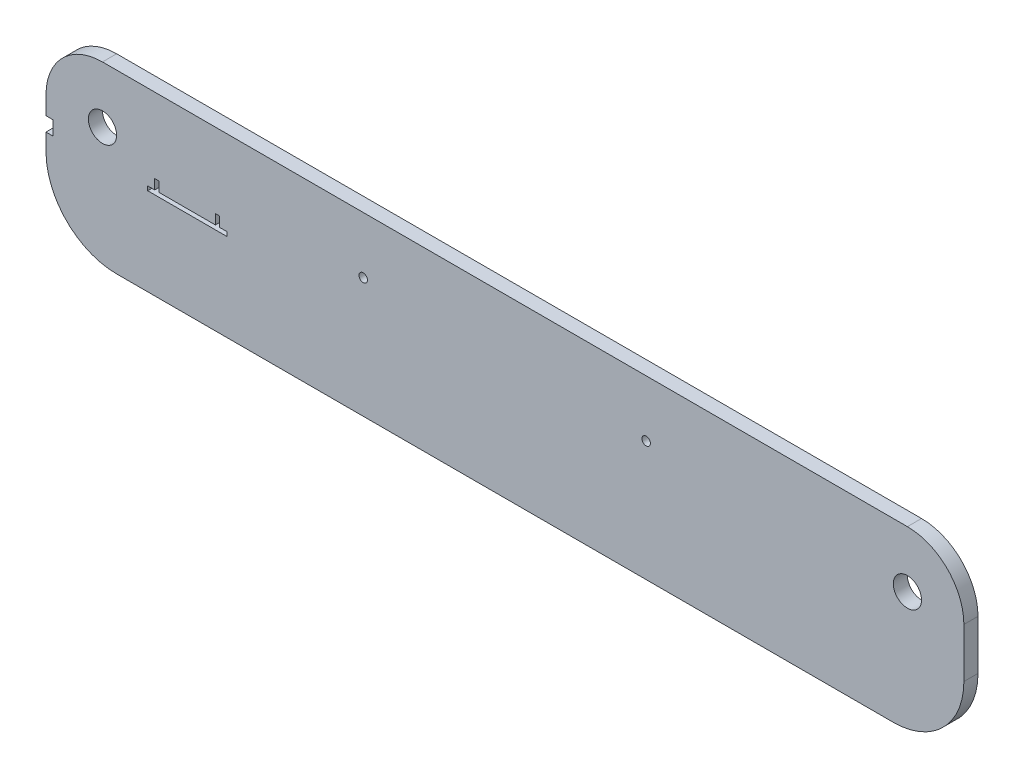
ISO-10303-21;
HEADER;
FILE_DESCRIPTION(('STEP AP214'),'2;1');
FILE_NAME('part.step','',(''),(''),'','','');
FILE_SCHEMA(('AUTOMOTIVE_DESIGN { 1 0 10303 214 1 1 1 1 }'));
ENDSEC;
DATA;
#1=APPLICATION_CONTEXT('core data for automotive mechanical design processes');
#2=APPLICATION_PROTOCOL_DEFINITION('international standard','automotive_design',2000,#1);
#3=PRODUCT_CONTEXT('',#1,'mechanical');
#4=PRODUCT('Part','Part','',(#3));
#5=PRODUCT_RELATED_PRODUCT_CATEGORY('part','',(#4));
#6=PRODUCT_DEFINITION_FORMATION('','',#4);
#7=PRODUCT_DEFINITION_CONTEXT('part definition',#1,'design');
#8=PRODUCT_DEFINITION('design','',#6,#7);
#9=PRODUCT_DEFINITION_SHAPE('','',#8);
#10=(LENGTH_UNIT() NAMED_UNIT(*) SI_UNIT(.MILLI.,.METRE.));
#11=(NAMED_UNIT(*) PLANE_ANGLE_UNIT() SI_UNIT($,.RADIAN.));
#12=(NAMED_UNIT(*) SI_UNIT($,.STERADIAN.) SOLID_ANGLE_UNIT());
#13=UNCERTAINTY_MEASURE_WITH_UNIT(LENGTH_MEASURE(1.E-05),#10,'distance_accuracy_value','');
#14=(GEOMETRIC_REPRESENTATION_CONTEXT(3) GLOBAL_UNCERTAINTY_ASSIGNED_CONTEXT((#13)) GLOBAL_UNIT_ASSIGNED_CONTEXT((#10,
#11,#12)) REPRESENTATION_CONTEXT('',''));
#15=CARTESIAN_POINT('',(0.,0.,0.));
#16=DIRECTION('',(0.,0.,1.));
#17=DIRECTION('',(1.,0.,0.));
#18=AXIS2_PLACEMENT_3D('',#15,#16,#17);
#19=CARTESIAN_POINT('',(0.,0.,10.));
#20=DIRECTION('',(0.,0.,1.));
#21=DIRECTION('',(1.,0.,0.));
#22=AXIS2_PLACEMENT_3D('',#19,#20,#21);
#23=PLANE('',#22);
#24=DIRECTION('',(0.,-1.,0.));
#25=VECTOR('',#24,1.);
#26=CARTESIAN_POINT('',(29.895928309746,35.3096819482084,10.));
#27=LINE('',#26,#25);
#28=CARTESIAN_POINT('',(29.895928309746,35.3096819482084,10.));
#29=VERTEX_POINT('',#28);
#30=CARTESIAN_POINT('',(29.895928309746,28.3096819482084,10.));
#31=VERTEX_POINT('',#30);
#32=EDGE_CURVE('E277',#29,#31,#27,.T.);
#33=ORIENTED_EDGE('',*,*,#32,.F.);
#34=DIRECTION('',(-1.,0.,0.));
#35=VECTOR('',#34,1.);
#36=CARTESIAN_POINT('',(32.895928309746,35.3096819482084,10.));
#37=LINE('',#36,#35);
#38=CARTESIAN_POINT('',(32.895928309746,35.3096819482084,10.));
#39=VERTEX_POINT('',#38);
#40=EDGE_CURVE('E284',#39,#29,#37,.T.);
#41=ORIENTED_EDGE('',*,*,#40,.F.);
#42=DIRECTION('',(0.,1.,0.));
#43=VECTOR('',#42,1.);
#44=CARTESIAN_POINT('',(32.895928309746,28.3096819482084,10.));
#45=LINE('',#44,#43);
#46=CARTESIAN_POINT('',(32.895928309746,28.3096819482084,10.));
#47=VERTEX_POINT('',#46);
#48=EDGE_CURVE('E282',#47,#39,#45,.T.);
#49=ORIENTED_EDGE('',*,*,#48,.F.);
#50=DIRECTION('',(-1.,0.,0.));
#51=VECTOR('',#50,1.);
#52=CARTESIAN_POINT('',(72.895928309746,28.3096819482084,10.));
#53=LINE('',#52,#51);
#54=CARTESIAN_POINT('',(72.895928309746,28.3096819482084,10.));
#55=VERTEX_POINT('',#54);
#56=EDGE_CURVE('E221',#55,#47,#53,.T.);
#57=ORIENTED_EDGE('',*,*,#56,.F.);
#58=DIRECTION('',(0.,1.,0.));
#59=VECTOR('',#58,1.);
#60=CARTESIAN_POINT('',(72.895928309746,0.,10.));
#61=LINE('',#60,#59);
#62=CARTESIAN_POINT('',(72.895928309746,35.3096819482084,10.));
#63=VERTEX_POINT('',#62);
#64=EDGE_CURVE('E206',#55,#63,#61,.T.);
#65=ORIENTED_EDGE('',*,*,#64,.T.);
#66=DIRECTION('',(1.,0.,0.));
#67=VECTOR('',#66,1.);
#68=CARTESIAN_POINT('',(-24.104071690254,35.3096819482084,10.));
#69=LINE('',#68,#67);
#70=CARTESIAN_POINT('',(75.895928309746,35.3096819482084,10.));
#71=VERTEX_POINT('',#70);
#72=EDGE_CURVE('E199',#63,#71,#69,.T.);
#73=ORIENTED_EDGE('',*,*,#72,.T.);
#74=DIRECTION('',(0.,1.,0.));
#75=VECTOR('',#74,1.);
#76=CARTESIAN_POINT('',(75.895928309746,71.3096819482084,10.));
#77=LINE('',#76,#75);
#78=CARTESIAN_POINT('',(75.895928309746,28.3096819482084,10.));
#79=VERTEX_POINT('',#78);
#80=EDGE_CURVE('E204',#79,#71,#77,.T.);
#81=ORIENTED_EDGE('',*,*,#80,.F.);
#82=DIRECTION('',(-1.,0.,0.));
#83=VECTOR('',#82,1.);
#84=CARTESIAN_POINT('',(0.,28.3096819482084,10.));
#85=LINE('',#84,#83);
#86=CARTESIAN_POINT('',(80.895928309746,28.3096819482084,10.));
#87=VERTEX_POINT('',#86);
#88=EDGE_CURVE('E235',#87,#79,#85,.T.);
#89=ORIENTED_EDGE('',*,*,#88,.F.);
#90=DIRECTION('',(0.,1.,0.));
#91=VECTOR('',#90,1.);
#92=CARTESIAN_POINT('',(80.895928309746,0.,10.));
#93=LINE('',#92,#91);
#94=CARTESIAN_POINT('',(80.895928309746,25.3096819482084,10.));
#95=VERTEX_POINT('',#94);
#96=EDGE_CURVE('E243',#95,#87,#93,.T.);
#97=ORIENTED_EDGE('',*,*,#96,.F.);
#98=DIRECTION('',(1.,0.,0.));
#99=VECTOR('',#98,1.);
#100=CARTESIAN_POINT('',(75.895928309746,25.3096819482084,10.));
#101=LINE('',#100,#99);
#102=CARTESIAN_POINT('',(24.895928309746,25.3096819482084,10.));
#103=VERTEX_POINT('',#102);
#104=EDGE_CURVE('E222',#103,#95,#101,.T.);
#105=ORIENTED_EDGE('',*,*,#104,.F.);
#106=DIRECTION('',(0.,1.,0.));
#107=VECTOR('',#106,1.);
#108=CARTESIAN_POINT('',(24.895928309746,0.,10.));
#109=LINE('',#108,#107);
#110=CARTESIAN_POINT('',(24.895928309746,28.3096819482084,10.));
#111=VERTEX_POINT('',#110);
#112=EDGE_CURVE('E240',#103,#111,#109,.T.);
#113=ORIENTED_EDGE('',*,*,#112,.T.);
#114=DIRECTION('',(1.,0.,0.));
#115=VECTOR('',#114,1.);
#116=CARTESIAN_POINT('',(0.,28.3096819482084,10.));
#117=LINE('',#116,#115);
#118=EDGE_CURVE('E237',#111,#31,#117,.T.);
#119=ORIENTED_EDGE('',*,*,#118,.T.);
#120=EDGE_LOOP('',(#33,#41,#49,#57,#65,#73,#81,#89,#97,#105,#113,#119));
#121=FACE_BOUND('',#120,.T.);
#122=CARTESIAN_POINT('',(2.89592830974606,13.3096819482084,10.));
#123=DIRECTION('',(0.,0.,1.));
#124=DIRECTION('',(1.,0.,0.));
#125=AXIS2_PLACEMENT_3D('',#122,#123,#124);
#126=CIRCLE('',#125,50.);
#127=CARTESIAN_POINT('',(-47.1040716902539,13.3096819482084,10.));
#128=VERTEX_POINT('',#127);
#129=CARTESIAN_POINT('',(2.89592830974606,-36.6903180517916,10.));
#130=VERTEX_POINT('',#129);
#131=EDGE_CURVE('E355',#128,#130,#126,.T.);
#132=ORIENTED_EDGE('',*,*,#131,.T.);
#133=DIRECTION('',(1.,0.,0.));
#134=VECTOR('',#133,1.);
#135=CARTESIAN_POINT('',(-47.1040716902539,-36.6903180517916,10.));
#136=LINE('',#135,#134);
#137=CARTESIAN_POINT('',(552.895928309746,-36.6903180517916,10.));
#138=VERTEX_POINT('',#137);
#139=EDGE_CURVE('E302',#130,#138,#136,.T.);
#140=ORIENTED_EDGE('',*,*,#139,.T.);
#141=CARTESIAN_POINT('',(552.895928309746,13.3096819482084,10.));
#142=DIRECTION('',(0.,0.,1.));
#143=DIRECTION('',(1.,0.,0.));
#144=AXIS2_PLACEMENT_3D('',#141,#142,#143);
#145=CIRCLE('',#144,50.);
#146=CARTESIAN_POINT('',(602.895928309746,13.3096819482084,10.));
#147=VERTEX_POINT('',#146);
#148=EDGE_CURVE('E335',#138,#147,#145,.T.);
#149=ORIENTED_EDGE('',*,*,#148,.T.);
#150=DIRECTION('',(0.,1.,0.));
#151=VECTOR('',#150,1.);
#152=CARTESIAN_POINT('',(602.895928309746,88.3096819482084,10.));
#153=LINE('',#152,#151);
#154=CARTESIAN_POINT('',(602.895928309746,48.3096819482084,10.));
#155=VERTEX_POINT('',#154);
#156=EDGE_CURVE('E305',#147,#155,#153,.T.);
#157=ORIENTED_EDGE('',*,*,#156,.T.);
#158=CARTESIAN_POINT('',(562.895928309746,48.3096819482084,10.));
#159=DIRECTION('',(0.,0.,1.));
#160=DIRECTION('',(1.,0.,0.));
#161=AXIS2_PLACEMENT_3D('',#158,#159,#160);
#162=CIRCLE('',#161,40.);
#163=CARTESIAN_POINT('',(562.895928309746,88.3096819482084,10.));
#164=VERTEX_POINT('',#163);
#165=EDGE_CURVE('E344',#155,#164,#162,.T.);
#166=ORIENTED_EDGE('',*,*,#165,.T.);
#167=DIRECTION('',(-1.,0.,0.));
#168=VECTOR('',#167,1.);
#169=CARTESIAN_POINT('',(-47.104071690254,88.3096819482084,10.));
#170=LINE('',#169,#168);
#171=CARTESIAN_POINT('',(-7.10407169025395,88.3096819482084,10.));
#172=VERTEX_POINT('',#171);
#173=EDGE_CURVE('E308',#164,#172,#170,.T.);
#174=ORIENTED_EDGE('',*,*,#173,.T.);
#175=CARTESIAN_POINT('',(-7.10407169025395,48.3096819482084,10.));
#176=DIRECTION('',(0.,0.,1.));
#177=DIRECTION('',(1.,0.,0.));
#178=AXIS2_PLACEMENT_3D('',#175,#176,#177);
#179=CIRCLE('',#178,40.);
#180=CARTESIAN_POINT('',(-47.1040716902539,48.3096819482084,10.));
#181=VERTEX_POINT('',#180);
#182=EDGE_CURVE('E11',#172,#181,#179,.T.);
#183=ORIENTED_EDGE('',*,*,#182,.T.);
#184=DIRECTION('',(0.,-1.,0.));
#185=VECTOR('',#184,1.);
#186=CARTESIAN_POINT('',(-47.104071690254,88.3096819482084,10.));
#187=LINE('',#186,#185);
#188=CARTESIAN_POINT('',(-47.1040716902539,35.3096819482083,10.));
#189=VERTEX_POINT('',#188);
#190=EDGE_CURVE('E299',#181,#189,#187,.T.);
#191=ORIENTED_EDGE('',*,*,#190,.T.);
#192=DIRECTION('',(-1.,0.,0.));
#193=VECTOR('',#192,1.);
#194=CARTESIAN_POINT('',(-42.104071690254,35.3096819482083,10.));
#195=LINE('',#194,#193);
#196=CARTESIAN_POINT('',(-42.104071690254,35.3096819482083,10.));
#197=VERTEX_POINT('',#196);
#198=EDGE_CURVE('E255',#197,#189,#195,.T.);
#199=ORIENTED_EDGE('',*,*,#198,.F.);
#200=DIRECTION('',(0.,1.,0.));
#201=VECTOR('',#200,1.);
#202=CARTESIAN_POINT('',(-42.104071690254,25.3096819482083,10.));
#203=LINE('',#202,#201);
#204=CARTESIAN_POINT('',(-42.104071690254,25.3096819482083,10.));
#205=VERTEX_POINT('',#204);
#206=EDGE_CURVE('E246',#205,#197,#203,.T.);
#207=ORIENTED_EDGE('',*,*,#206,.F.);
#208=DIRECTION('',(-1.,0.,0.));
#209=VECTOR('',#208,1.);
#210=CARTESIAN_POINT('',(-42.104071690254,25.3096819482083,10.));
#211=LINE('',#210,#209);
#212=CARTESIAN_POINT('',(-47.1040716902539,25.3096819482083,10.));
#213=VERTEX_POINT('',#212);
#214=EDGE_CURVE('E258',#205,#213,#211,.T.);
#215=ORIENTED_EDGE('',*,*,#214,.T.);
#216=EDGE_CURVE('E303',#213,#128,#187,.T.);
#217=ORIENTED_EDGE('',*,*,#216,.T.);
#218=EDGE_LOOP('',(#132,#140,#149,#157,#166,#174,#183,#191,#199,#207,#215,#217));
#219=FACE_BOUND('',#218,.T.);
#220=CARTESIAN_POINT('',(177.509070800599,48.3096819482085,10.));
#221=DIRECTION('',(0.,0.,1.));
#222=DIRECTION('',(1.,0.,0.));
#223=AXIS2_PLACEMENT_3D('',#220,#221,#222);
#224=CIRCLE('',#223,2.99999999999999);
#225=CARTESIAN_POINT('',(180.509070800599,48.3096819482085,10.));
#226=VERTEX_POINT('',#225);
#227=EDGE_CURVE('E271',#226,#226,#224,.T.);
#228=ORIENTED_EDGE('',*,*,#227,.F.);
#229=EDGE_LOOP('',(#228));
#230=FACE_BOUND('',#229,.T.);
#231=CARTESIAN_POINT('',(377.895928309746,48.3096819482086,10.));
#232=DIRECTION('',(0.,0.,1.));
#233=DIRECTION('',(1.,0.,0.));
#234=AXIS2_PLACEMENT_3D('',#231,#232,#233);
#235=CIRCLE('',#234,2.99999999999999);
#236=CARTESIAN_POINT('',(380.895928309746,48.3096819482086,10.));
#237=VERTEX_POINT('',#236);
#238=EDGE_CURVE('E270',#237,#237,#235,.T.);
#239=ORIENTED_EDGE('',*,*,#238,.F.);
#240=EDGE_LOOP('',(#239));
#241=FACE_BOUND('',#240,.T.);
#242=CARTESIAN_POINT('',(562.895928309746,48.3096819482086,10.));
#243=DIRECTION('',(0.,0.,1.));
#244=DIRECTION('',(-1.,0.,0.));
#245=AXIS2_PLACEMENT_3D('',#242,#243,#244);
#246=CIRCLE('',#245,9.99999999999998);
#247=CARTESIAN_POINT('',(552.895928309746,48.3096819482086,10.));
#248=VERTEX_POINT('',#247);
#249=EDGE_CURVE('E286',#248,#248,#246,.T.);
#250=ORIENTED_EDGE('',*,*,#249,.F.);
#251=EDGE_LOOP('',(#250));
#252=FACE_BOUND('',#251,.T.);
#253=CARTESIAN_POINT('',(-7.10407169025393,48.3096819482084,10.));
#254=DIRECTION('',(0.,0.,1.));
#255=DIRECTION('',(1.,0.,0.));
#256=AXIS2_PLACEMENT_3D('',#253,#254,#255);
#257=CIRCLE('',#256,10.);
#258=CARTESIAN_POINT('',(2.89592830974607,48.3096819482084,10.));
#259=VERTEX_POINT('',#258);
#260=EDGE_CURVE('E290',#259,#259,#257,.T.);
#261=ORIENTED_EDGE('',*,*,#260,.F.);
#262=EDGE_LOOP('',(#261));
#263=FACE_BOUND('',#262,.T.);
#264=ADVANCED_FACE('F38',(#121,#219,#230,#241,#252,#263),#23,.T.);
#265=CARTESIAN_POINT('',(0.,0.,0.));
#266=DIRECTION('',(0.,0.,1.));
#267=DIRECTION('',(1.,0.,0.));
#268=AXIS2_PLACEMENT_3D('',#265,#266,#267);
#269=PLANE('',#268);
#270=CARTESIAN_POINT('',(-7.10407169025393,48.3096819482084,0.));
#271=DIRECTION('',(0.,0.,1.));
#272=DIRECTION('',(1.,0.,0.));
#273=AXIS2_PLACEMENT_3D('',#270,#271,#272);
#274=CIRCLE('',#273,10.);
#275=CARTESIAN_POINT('',(2.89592830974607,48.3096819482084,0.));
#276=VERTEX_POINT('',#275);
#277=EDGE_CURVE('E293',#276,#276,#274,.T.);
#278=ORIENTED_EDGE('',*,*,#277,.T.);
#279=EDGE_LOOP('',(#278));
#280=FACE_BOUND('',#279,.T.);
#281=CARTESIAN_POINT('',(562.895928309746,48.3096819482086,0.));
#282=DIRECTION('',(0.,0.,1.));
#283=DIRECTION('',(-1.,0.,0.));
#284=AXIS2_PLACEMENT_3D('',#281,#282,#283);
#285=CIRCLE('',#284,9.99999999999998);
#286=CARTESIAN_POINT('',(552.895928309746,48.3096819482086,0.));
#287=VERTEX_POINT('',#286);
#288=EDGE_CURVE('E287',#287,#287,#285,.T.);
#289=ORIENTED_EDGE('',*,*,#288,.T.);
#290=EDGE_LOOP('',(#289));
#291=FACE_BOUND('',#290,.T.);
#292=CARTESIAN_POINT('',(377.895928309746,48.3096819482086,0.));
#293=DIRECTION('',(0.,0.,1.));
#294=DIRECTION('',(1.,0.,0.));
#295=AXIS2_PLACEMENT_3D('',#292,#293,#294);
#296=CIRCLE('',#295,2.99999999999999);
#297=CARTESIAN_POINT('',(380.895928309746,48.3096819482086,0.));
#298=VERTEX_POINT('',#297);
#299=EDGE_CURVE('E274',#298,#298,#296,.T.);
#300=ORIENTED_EDGE('',*,*,#299,.T.);
#301=EDGE_LOOP('',(#300));
#302=FACE_BOUND('',#301,.T.);
#303=CARTESIAN_POINT('',(177.509070800599,48.3096819482085,0.));
#304=DIRECTION('',(0.,0.,1.));
#305=DIRECTION('',(1.,0.,0.));
#306=AXIS2_PLACEMENT_3D('',#303,#304,#305);
#307=CIRCLE('',#306,2.99999999999999);
#308=CARTESIAN_POINT('',(180.509070800599,48.3096819482085,0.));
#309=VERTEX_POINT('',#308);
#310=EDGE_CURVE('E279',#309,#309,#307,.T.);
#311=ORIENTED_EDGE('',*,*,#310,.T.);
#312=EDGE_LOOP('',(#311));
#313=FACE_BOUND('',#312,.T.);
#314=DIRECTION('',(0.,-1.,0.));
#315=VECTOR('',#314,1.);
#316=CARTESIAN_POINT('',(-47.104071690254,88.3096819482084,0.));
#317=LINE('',#316,#315);
#318=CARTESIAN_POINT('',(-47.1040716902539,25.3096819482083,0.));
#319=VERTEX_POINT('',#318);
#320=CARTESIAN_POINT('',(-47.1040716902539,13.3096819482084,0.));
#321=VERTEX_POINT('',#320);
#322=EDGE_CURVE('E296',#319,#321,#317,.T.);
#323=ORIENTED_EDGE('',*,*,#322,.F.);
#324=DIRECTION('',(-1.,0.,0.));
#325=VECTOR('',#324,1.);
#326=CARTESIAN_POINT('',(-42.104071690254,25.3096819482083,0.));
#327=LINE('',#326,#325);
#328=CARTESIAN_POINT('',(-42.104071690254,25.3096819482083,0.));
#329=VERTEX_POINT('',#328);
#330=EDGE_CURVE('E261',#329,#319,#327,.T.);
#331=ORIENTED_EDGE('',*,*,#330,.F.);
#332=DIRECTION('',(0.,-1.,0.));
#333=VECTOR('',#332,1.);
#334=CARTESIAN_POINT('',(-42.104071690254,25.3096819482083,0.));
#335=LINE('',#334,#333);
#336=CARTESIAN_POINT('',(-42.104071690254,35.3096819482083,0.));
#337=VERTEX_POINT('',#336);
#338=EDGE_CURVE('E250',#337,#329,#335,.T.);
#339=ORIENTED_EDGE('',*,*,#338,.F.);
#340=DIRECTION('',(-1.,0.,0.));
#341=VECTOR('',#340,1.);
#342=CARTESIAN_POINT('',(-42.104071690254,35.3096819482083,0.));
#343=LINE('',#342,#341);
#344=CARTESIAN_POINT('',(-47.1040716902539,35.3096819482083,0.));
#345=VERTEX_POINT('',#344);
#346=EDGE_CURVE('E263',#337,#345,#343,.T.);
#347=ORIENTED_EDGE('',*,*,#346,.T.);
#348=CARTESIAN_POINT('',(-47.1040716902539,48.3096819482084,0.));
#349=VERTEX_POINT('',#348);
#350=EDGE_CURVE('E312',#349,#345,#317,.T.);
#351=ORIENTED_EDGE('',*,*,#350,.F.);
#352=CARTESIAN_POINT('',(-7.10407169025395,48.3096819482084,0.));
#353=DIRECTION('',(0.,0.,1.));
#354=DIRECTION('',(1.,0.,0.));
#355=AXIS2_PLACEMENT_3D('',#352,#353,#354);
#356=CIRCLE('',#355,40.);
#357=CARTESIAN_POINT('',(-7.10407169025395,88.3096819482084,0.));
#358=VERTEX_POINT('',#357);
#359=EDGE_CURVE('E361',#349,#358,#356,.F.);
#360=ORIENTED_EDGE('',*,*,#359,.T.);
#361=DIRECTION('',(-1.,0.,0.));
#362=VECTOR('',#361,1.);
#363=CARTESIAN_POINT('',(-47.104071690254,88.3096819482084,0.));
#364=LINE('',#363,#362);
#365=CARTESIAN_POINT('',(562.895928309746,88.3096819482084,0.));
#366=VERTEX_POINT('',#365);
#367=EDGE_CURVE('E320',#366,#358,#364,.T.);
#368=ORIENTED_EDGE('',*,*,#367,.F.);
#369=CARTESIAN_POINT('',(562.895928309746,48.3096819482084,0.));
#370=DIRECTION('',(0.,0.,1.));
#371=DIRECTION('',(1.,0.,0.));
#372=AXIS2_PLACEMENT_3D('',#369,#370,#371);
#373=CIRCLE('',#372,40.);
#374=CARTESIAN_POINT('',(602.895928309746,48.3096819482084,0.));
#375=VERTEX_POINT('',#374);
#376=EDGE_CURVE('E340',#366,#375,#373,.F.);
#377=ORIENTED_EDGE('',*,*,#376,.T.);
#378=DIRECTION('',(0.,1.,0.));
#379=VECTOR('',#378,1.);
#380=CARTESIAN_POINT('',(602.895928309746,88.3096819482084,0.));
#381=LINE('',#380,#379);
#382=CARTESIAN_POINT('',(602.895928309746,13.3096819482084,0.));
#383=VERTEX_POINT('',#382);
#384=EDGE_CURVE('E317',#383,#375,#381,.T.);
#385=ORIENTED_EDGE('',*,*,#384,.F.);
#386=CARTESIAN_POINT('',(552.895928309746,13.3096819482084,0.));
#387=DIRECTION('',(0.,0.,1.));
#388=DIRECTION('',(1.,0.,0.));
#389=AXIS2_PLACEMENT_3D('',#386,#387,#388);
#390=CIRCLE('',#389,50.);
#391=CARTESIAN_POINT('',(552.895928309746,-36.6903180517916,0.));
#392=VERTEX_POINT('',#391);
#393=EDGE_CURVE('E329',#383,#392,#390,.F.);
#394=ORIENTED_EDGE('',*,*,#393,.T.);
#395=DIRECTION('',(1.,0.,0.));
#396=VECTOR('',#395,1.);
#397=CARTESIAN_POINT('',(-47.1040716902539,-36.6903180517916,0.));
#398=LINE('',#397,#396);
#399=CARTESIAN_POINT('',(2.89592830974606,-36.6903180517916,0.));
#400=VERTEX_POINT('',#399);
#401=EDGE_CURVE('E315',#400,#392,#398,.T.);
#402=ORIENTED_EDGE('',*,*,#401,.F.);
#403=CARTESIAN_POINT('',(2.89592830974606,13.3096819482084,0.));
#404=DIRECTION('',(0.,0.,1.));
#405=DIRECTION('',(1.,0.,0.));
#406=AXIS2_PLACEMENT_3D('',#403,#404,#405);
#407=CIRCLE('',#406,50.);
#408=EDGE_CURVE('E349',#400,#321,#407,.F.);
#409=ORIENTED_EDGE('',*,*,#408,.T.);
#410=EDGE_LOOP('',(#323,#331,#339,#347,#351,#360,#368,#377,#385,#394,#402,#409));
#411=FACE_BOUND('',#410,.T.);
#412=DIRECTION('',(0.,1.,0.));
#413=VECTOR('',#412,1.);
#414=CARTESIAN_POINT('',(72.895928309746,28.3096819482084,0.));
#415=LINE('',#414,#413);
#416=CARTESIAN_POINT('',(72.895928309746,28.3096819482084,0.));
#417=VERTEX_POINT('',#416);
#418=CARTESIAN_POINT('',(72.895928309746,35.3096819482084,0.));
#419=VERTEX_POINT('',#418);
#420=EDGE_CURVE('E211',#417,#419,#415,.T.);
#421=ORIENTED_EDGE('',*,*,#420,.F.);
#422=DIRECTION('',(1.,0.,0.));
#423=VECTOR('',#422,1.);
#424=CARTESIAN_POINT('',(32.895928309746,28.3096819482084,0.));
#425=LINE('',#424,#423);
#426=CARTESIAN_POINT('',(32.895928309746,28.3096819482084,0.));
#427=VERTEX_POINT('',#426);
#428=EDGE_CURVE('E741',#427,#417,#425,.T.);
#429=ORIENTED_EDGE('',*,*,#428,.F.);
#430=DIRECTION('',(0.,-1.,0.));
#431=VECTOR('',#430,1.);
#432=CARTESIAN_POINT('',(32.895928309746,35.3096819482084,0.));
#433=LINE('',#432,#431);
#434=CARTESIAN_POINT('',(32.895928309746,35.3096819482084,0.));
#435=VERTEX_POINT('',#434);
#436=EDGE_CURVE('E767',#435,#427,#433,.T.);
#437=ORIENTED_EDGE('',*,*,#436,.F.);
#438=DIRECTION('',(1.,0.,0.));
#439=VECTOR('',#438,1.);
#440=CARTESIAN_POINT('',(29.895928309746,35.3096819482084,0.));
#441=LINE('',#440,#439);
#442=CARTESIAN_POINT('',(29.895928309746,35.3096819482084,0.));
#443=VERTEX_POINT('',#442);
#444=EDGE_CURVE('E765',#443,#435,#441,.T.);
#445=ORIENTED_EDGE('',*,*,#444,.F.);
#446=DIRECTION('',(0.,1.,0.));
#447=VECTOR('',#446,1.);
#448=CARTESIAN_POINT('',(29.895928309746,28.3096819482084,0.));
#449=LINE('',#448,#447);
#450=CARTESIAN_POINT('',(29.895928309746,28.3096819482084,0.));
#451=VERTEX_POINT('',#450);
#452=EDGE_CURVE('E763',#451,#443,#449,.T.);
#453=ORIENTED_EDGE('',*,*,#452,.F.);
#454=DIRECTION('',(1.,0.,0.));
#455=VECTOR('',#454,1.);
#456=CARTESIAN_POINT('',(24.895928309746,28.3096819482084,0.));
#457=LINE('',#456,#455);
#458=CARTESIAN_POINT('',(24.895928309746,28.3096819482084,0.));
#459=VERTEX_POINT('',#458);
#460=EDGE_CURVE('E761',#459,#451,#457,.T.);
#461=ORIENTED_EDGE('',*,*,#460,.F.);
#462=DIRECTION('',(0.,1.,0.));
#463=VECTOR('',#462,1.);
#464=CARTESIAN_POINT('',(24.895928309746,25.3096819482084,0.));
#465=LINE('',#464,#463);
#466=CARTESIAN_POINT('',(24.895928309746,25.3096819482084,0.));
#467=VERTEX_POINT('',#466);
#468=EDGE_CURVE('E759',#467,#459,#465,.T.);
#469=ORIENTED_EDGE('',*,*,#468,.F.);
#470=DIRECTION('',(1.,0.,0.));
#471=VECTOR('',#470,1.);
#472=CARTESIAN_POINT('',(75.895928309746,25.3096819482084,0.));
#473=LINE('',#472,#471);
#474=CARTESIAN_POINT('',(80.895928309746,25.3096819482084,0.));
#475=VERTEX_POINT('',#474);
#476=EDGE_CURVE('E756',#467,#475,#473,.T.);
#477=ORIENTED_EDGE('',*,*,#476,.T.);
#478=DIRECTION('',(0.,1.,0.));
#479=VECTOR('',#478,1.);
#480=CARTESIAN_POINT('',(80.895928309746,25.3096819482084,0.));
#481=LINE('',#480,#479);
#482=CARTESIAN_POINT('',(80.895928309746,28.3096819482084,0.));
#483=VERTEX_POINT('',#482);
#484=EDGE_CURVE('E753',#475,#483,#481,.T.);
#485=ORIENTED_EDGE('',*,*,#484,.T.);
#486=DIRECTION('',(-1.,0.,0.));
#487=VECTOR('',#486,1.);
#488=CARTESIAN_POINT('',(80.895928309746,28.3096819482084,0.));
#489=LINE('',#488,#487);
#490=CARTESIAN_POINT('',(75.895928309746,28.3096819482084,0.));
#491=VERTEX_POINT('',#490);
#492=EDGE_CURVE('E750',#483,#491,#489,.T.);
#493=ORIENTED_EDGE('',*,*,#492,.T.);
#494=DIRECTION('',(0.,1.,0.));
#495=VECTOR('',#494,1.);
#496=CARTESIAN_POINT('',(75.895928309746,28.3096819482084,0.));
#497=LINE('',#496,#495);
#498=CARTESIAN_POINT('',(75.895928309746,35.3096819482084,0.));
#499=VERTEX_POINT('',#498);
#500=EDGE_CURVE('E746',#491,#499,#497,.T.);
#501=ORIENTED_EDGE('',*,*,#500,.T.);
#502=DIRECTION('',(1.,0.,0.));
#503=VECTOR('',#502,1.);
#504=CARTESIAN_POINT('',(72.895928309746,35.3096819482084,0.));
#505=LINE('',#504,#503);
#506=EDGE_CURVE('E226',#419,#499,#505,.T.);
#507=ORIENTED_EDGE('',*,*,#506,.F.);
#508=EDGE_LOOP('',(#421,#429,#437,#445,#453,#461,#469,#477,#485,#493,#501,#507));
#509=FACE_BOUND('',#508,.T.);
#510=ADVANCED_FACE('F381',(#280,#291,#302,#313,#411,#509),#269,.F.);
#511=CARTESIAN_POINT('',(-47.104071690254,88.3096819482084,10.));
#512=DIRECTION('',(1.,0.,0.));
#513=DIRECTION('',(0.,1.,0.));
#514=AXIS2_PLACEMENT_3D('',#511,#512,#513);
#515=PLANE('',#514);
#516=ORIENTED_EDGE('',*,*,#216,.F.);
#517=DIRECTION('',(0.,0.,1.));
#518=VECTOR('',#517,1.);
#519=CARTESIAN_POINT('',(-47.1040716902539,25.3096819482083,10.));
#520=LINE('',#519,#518);
#521=EDGE_CURVE('E248',#319,#213,#520,.T.);
#522=ORIENTED_EDGE('',*,*,#521,.F.);
#523=ORIENTED_EDGE('',*,*,#322,.T.);
#524=DIRECTION('',(0.,0.,-1.));
#525=VECTOR('',#524,1.);
#526=CARTESIAN_POINT('',(-47.1040716902539,13.3096819482084,10.));
#527=LINE('',#526,#525);
#528=EDGE_CURVE('E352',#321,#128,#527,.F.);
#529=ORIENTED_EDGE('',*,*,#528,.T.);
#530=EDGE_LOOP('',(#516,#522,#523,#529));
#531=FACE_BOUND('',#530,.T.);
#532=ADVANCED_FACE('F399',(#531),#515,.F.);
#533=ORIENTED_EDGE('',*,*,#350,.T.);
#534=DIRECTION('',(0.,0.,-1.));
#535=VECTOR('',#534,1.);
#536=CARTESIAN_POINT('',(-47.1040716902539,35.3096819482083,10.));
#537=LINE('',#536,#535);
#538=EDGE_CURVE('E245',#189,#345,#537,.T.);
#539=ORIENTED_EDGE('',*,*,#538,.F.);
#540=ORIENTED_EDGE('',*,*,#190,.F.);
#541=DIRECTION('',(0.,0.,-1.));
#542=VECTOR('',#541,1.);
#543=CARTESIAN_POINT('',(-47.1040716902539,48.3096819482084,10.));
#544=LINE('',#543,#542);
#545=EDGE_CURVE('E358',#181,#349,#544,.T.);
#546=ORIENTED_EDGE('',*,*,#545,.T.);
#547=EDGE_LOOP('',(#533,#539,#540,#546));
#548=FACE_BOUND('',#547,.T.);
#549=ADVANCED_FACE('F377',(#548),#515,.F.);
#550=CARTESIAN_POINT('',(-47.1040716902539,-36.6903180517916,10.));
#551=DIRECTION('',(0.,1.,0.));
#552=DIRECTION('',(0.,0.,1.));
#553=AXIS2_PLACEMENT_3D('',#550,#551,#552);
#554=PLANE('',#553);
#555=DIRECTION('',(0.,0.,-1.));
#556=VECTOR('',#555,1.);
#557=CARTESIAN_POINT('',(552.895928309746,-36.6903180517916,10.));
#558=LINE('',#557,#556);
#559=EDGE_CURVE('E332',#392,#138,#558,.F.);
#560=ORIENTED_EDGE('',*,*,#559,.T.);
#561=ORIENTED_EDGE('',*,*,#139,.F.);
#562=DIRECTION('',(0.,0.,-1.));
#563=VECTOR('',#562,1.);
#564=CARTESIAN_POINT('',(2.89592830974606,-36.6903180517916,10.));
#565=LINE('',#564,#563);
#566=EDGE_CURVE('E346',#130,#400,#565,.T.);
#567=ORIENTED_EDGE('',*,*,#566,.T.);
#568=ORIENTED_EDGE('',*,*,#401,.T.);
#569=EDGE_LOOP('',(#560,#561,#567,#568));
#570=FACE_BOUND('',#569,.T.);
#571=ADVANCED_FACE('F405',(#570),#554,.F.);
#572=CARTESIAN_POINT('',(602.895928309746,88.3096819482084,10.));
#573=DIRECTION('',(-1.,0.,0.));
#574=DIRECTION('',(0.,0.,1.));
#575=AXIS2_PLACEMENT_3D('',#572,#573,#574);
#576=PLANE('',#575);
#577=ORIENTED_EDGE('',*,*,#384,.T.);
#578=DIRECTION('',(0.,0.,-1.));
#579=VECTOR('',#578,1.);
#580=CARTESIAN_POINT('',(602.895928309746,48.3096819482084,10.));
#581=LINE('',#580,#579);
#582=EDGE_CURVE('E342',#375,#155,#581,.F.);
#583=ORIENTED_EDGE('',*,*,#582,.T.);
#584=ORIENTED_EDGE('',*,*,#156,.F.);
#585=DIRECTION('',(0.,0.,-1.));
#586=VECTOR('',#585,1.);
#587=CARTESIAN_POINT('',(602.895928309746,13.3096819482084,10.));
#588=LINE('',#587,#586);
#589=EDGE_CURVE('E311',#147,#383,#588,.T.);
#590=ORIENTED_EDGE('',*,*,#589,.T.);
#591=EDGE_LOOP('',(#577,#583,#584,#590));
#592=FACE_BOUND('',#591,.T.);
#593=ADVANCED_FACE('F414',(#592),#576,.F.);
#594=CARTESIAN_POINT('',(-47.104071690254,88.3096819482084,10.));
#595=DIRECTION('',(0.,-1.,0.));
#596=DIRECTION('',(0.,0.,-1.));
#597=AXIS2_PLACEMENT_3D('',#594,#595,#596);
#598=PLANE('',#597);
#599=ORIENTED_EDGE('',*,*,#367,.T.);
#600=DIRECTION('',(0.,0.,-1.));
#601=VECTOR('',#600,1.);
#602=CARTESIAN_POINT('',(-7.10407169025395,88.3096819482084,10.));
#603=LINE('',#602,#601);
#604=EDGE_CURVE('E47',#358,#172,#603,.F.);
#605=ORIENTED_EDGE('',*,*,#604,.T.);
#606=ORIENTED_EDGE('',*,*,#173,.F.);
#607=DIRECTION('',(0.,0.,-1.));
#608=VECTOR('',#607,1.);
#609=CARTESIAN_POINT('',(562.895928309746,88.3096819482084,10.));
#610=LINE('',#609,#608);
#611=EDGE_CURVE('E337',#164,#366,#610,.T.);
#612=ORIENTED_EDGE('',*,*,#611,.T.);
#613=EDGE_LOOP('',(#599,#605,#606,#612));
#614=FACE_BOUND('',#613,.T.);
#615=ADVANCED_FACE('F366',(#614),#598,.F.);
#616=CARTESIAN_POINT('',(-7.10407169025393,48.3096819482084,0.));
#617=DIRECTION('',(0.,0.,1.));
#618=DIRECTION('',(1.,0.,0.));
#619=AXIS2_PLACEMENT_3D('',#616,#617,#618);
#620=CYLINDRICAL_SURFACE('',#619,10.);
#621=ORIENTED_EDGE('',*,*,#277,.F.);
#622=EDGE_LOOP('',(#621));
#623=FACE_BOUND('',#622,.T.);
#624=ORIENTED_EDGE('',*,*,#260,.T.);
#625=EDGE_LOOP('',(#624));
#626=FACE_BOUND('',#625,.T.);
#627=ADVANCED_FACE('F437',(#623,#626),#620,.F.);
#628=CARTESIAN_POINT('',(562.895928309746,48.3096819482086,0.));
#629=DIRECTION('',(0.,0.,1.));
#630=DIRECTION('',(1.,0.,0.));
#631=AXIS2_PLACEMENT_3D('',#628,#629,#630);
#632=CYLINDRICAL_SURFACE('',#631,9.99999999999998);
#633=ORIENTED_EDGE('',*,*,#288,.F.);
#634=EDGE_LOOP('',(#633));
#635=FACE_BOUND('',#634,.T.);
#636=ORIENTED_EDGE('',*,*,#249,.T.);
#637=EDGE_LOOP('',(#636));
#638=FACE_BOUND('',#637,.T.);
#639=ADVANCED_FACE('F511',(#635,#638),#632,.F.);
#640=CARTESIAN_POINT('',(377.895928309746,48.3096819482086,-10.));
#641=DIRECTION('',(0.,0.,1.));
#642=DIRECTION('',(1.,0.,0.));
#643=AXIS2_PLACEMENT_3D('',#640,#641,#642);
#644=CYLINDRICAL_SURFACE('',#643,2.99999999999999);
#645=ORIENTED_EDGE('',*,*,#238,.T.);
#646=EDGE_LOOP('',(#645));
#647=FACE_BOUND('',#646,.T.);
#648=ORIENTED_EDGE('',*,*,#299,.F.);
#649=EDGE_LOOP('',(#648));
#650=FACE_BOUND('',#649,.T.);
#651=ADVANCED_FACE('F501',(#647,#650),#644,.F.);
#652=CARTESIAN_POINT('',(177.509070800599,48.3096819482085,-10.));
#653=DIRECTION('',(0.,0.,1.));
#654=DIRECTION('',(1.,0.,0.));
#655=AXIS2_PLACEMENT_3D('',#652,#653,#654);
#656=CYLINDRICAL_SURFACE('',#655,2.99999999999999);
#657=ORIENTED_EDGE('',*,*,#227,.T.);
#658=EDGE_LOOP('',(#657));
#659=FACE_BOUND('',#658,.T.);
#660=ORIENTED_EDGE('',*,*,#310,.F.);
#661=EDGE_LOOP('',(#660));
#662=FACE_BOUND('',#661,.T.);
#663=ADVANCED_FACE('F425',(#659,#662),#656,.F.);
#664=CARTESIAN_POINT('',(552.895928309746,13.3096819482084,10.));
#665=DIRECTION('',(0.,0.,-1.));
#666=DIRECTION('',(-1.,0.,0.));
#667=AXIS2_PLACEMENT_3D('',#664,#665,#666);
#668=CYLINDRICAL_SURFACE('',#667,50.);
#669=ORIENTED_EDGE('',*,*,#148,.F.);
#670=ORIENTED_EDGE('',*,*,#559,.F.);
#671=ORIENTED_EDGE('',*,*,#393,.F.);
#672=ORIENTED_EDGE('',*,*,#589,.F.);
#673=EDGE_LOOP('',(#669,#670,#671,#672));
#674=FACE_BOUND('',#673,.T.);
#675=ADVANCED_FACE('F411',(#674),#668,.T.);
#676=CARTESIAN_POINT('',(562.895928309746,48.3096819482084,10.));
#677=DIRECTION('',(0.,0.,-1.));
#678=DIRECTION('',(-1.,0.,0.));
#679=AXIS2_PLACEMENT_3D('',#676,#677,#678);
#680=CYLINDRICAL_SURFACE('',#679,40.);
#681=ORIENTED_EDGE('',*,*,#165,.F.);
#682=ORIENTED_EDGE('',*,*,#582,.F.);
#683=ORIENTED_EDGE('',*,*,#376,.F.);
#684=ORIENTED_EDGE('',*,*,#611,.F.);
#685=EDGE_LOOP('',(#681,#682,#683,#684));
#686=FACE_BOUND('',#685,.T.);
#687=ADVANCED_FACE('F417',(#686),#680,.T.);
#688=CARTESIAN_POINT('',(2.89592830974606,13.3096819482084,10.));
#689=DIRECTION('',(0.,0.,-1.));
#690=DIRECTION('',(-1.,0.,0.));
#691=AXIS2_PLACEMENT_3D('',#688,#689,#690);
#692=CYLINDRICAL_SURFACE('',#691,50.);
#693=ORIENTED_EDGE('',*,*,#131,.F.);
#694=ORIENTED_EDGE('',*,*,#528,.F.);
#695=ORIENTED_EDGE('',*,*,#408,.F.);
#696=ORIENTED_EDGE('',*,*,#566,.F.);
#697=EDGE_LOOP('',(#693,#694,#695,#696));
#698=FACE_BOUND('',#697,.T.);
#699=ADVANCED_FACE('F403',(#698),#692,.T.);
#700=CARTESIAN_POINT('',(-7.10407169025395,48.3096819482084,10.));
#701=DIRECTION('',(0.,0.,-1.));
#702=DIRECTION('',(-1.,0.,0.));
#703=AXIS2_PLACEMENT_3D('',#700,#701,#702);
#704=CYLINDRICAL_SURFACE('',#703,40.);
#705=ORIENTED_EDGE('',*,*,#182,.F.);
#706=ORIENTED_EDGE('',*,*,#604,.F.);
#707=ORIENTED_EDGE('',*,*,#359,.F.);
#708=ORIENTED_EDGE('',*,*,#545,.F.);
#709=EDGE_LOOP('',(#705,#706,#707,#708));
#710=FACE_BOUND('',#709,.T.);
#711=ADVANCED_FACE('F40',(#710),#704,.T.);
#712=CARTESIAN_POINT('',(-42.104071690254,0.,0.));
#713=DIRECTION('',(-1.,0.,0.));
#714=DIRECTION('',(0.,0.,1.));
#715=AXIS2_PLACEMENT_3D('',#712,#713,#714);
#716=PLANE('',#715);
#717=ORIENTED_EDGE('',*,*,#206,.T.);
#718=DIRECTION('',(0.,0.,-1.));
#719=VECTOR('',#718,1.);
#720=CARTESIAN_POINT('',(-42.104071690254,35.3096819482083,10.));
#721=LINE('',#720,#719);
#722=EDGE_CURVE('E62',#197,#337,#721,.T.);
#723=ORIENTED_EDGE('',*,*,#722,.T.);
#724=ORIENTED_EDGE('',*,*,#338,.T.);
#725=DIRECTION('',(0.,0.,1.));
#726=VECTOR('',#725,1.);
#727=CARTESIAN_POINT('',(-42.104071690254,25.3096819482083,10.));
#728=LINE('',#727,#726);
#729=EDGE_CURVE('E252',#329,#205,#728,.T.);
#730=ORIENTED_EDGE('',*,*,#729,.T.);
#731=EDGE_LOOP('',(#717,#723,#724,#730));
#732=FACE_BOUND('',#731,.T.);
#733=CARTESIAN_POINT('',(-42.104071690254,30.3096819482083,5.));
#734=DIRECTION('',(-1.,0.,0.));
#735=DIRECTION('',(0.,0.,1.));
#736=AXIS2_PLACEMENT_3D('',#733,#734,#735);
#737=CIRCLE('',#736,3.);
#738=CARTESIAN_POINT('',(-42.104071690254,30.3096819482083,8.));
#739=VERTEX_POINT('',#738);
#740=EDGE_CURVE('E42',#739,#739,#737,.F.);
#741=ORIENTED_EDGE('',*,*,#740,.T.);
#742=EDGE_LOOP('',(#741));
#743=FACE_BOUND('',#742,.T.);
#744=ADVANCED_FACE('F390',(#732,#743),#716,.T.);
#745=CARTESIAN_POINT('',(-42.104071690254,25.3096819482083,10.));
#746=DIRECTION('',(0.,-1.,0.));
#747=DIRECTION('',(1.,0.,0.));
#748=AXIS2_PLACEMENT_3D('',#745,#746,#747);
#749=PLANE('',#748);
#750=ORIENTED_EDGE('',*,*,#521,.T.);
#751=ORIENTED_EDGE('',*,*,#214,.F.);
#752=ORIENTED_EDGE('',*,*,#729,.F.);
#753=ORIENTED_EDGE('',*,*,#330,.T.);
#754=EDGE_LOOP('',(#750,#751,#752,#753));
#755=FACE_BOUND('',#754,.T.);
#756=ADVANCED_FACE('F394',(#755),#749,.F.);
#757=CARTESIAN_POINT('',(-42.104071690254,35.3096819482083,10.));
#758=DIRECTION('',(0.,1.,0.));
#759=DIRECTION('',(-1.,0.,0.));
#760=AXIS2_PLACEMENT_3D('',#757,#758,#759);
#761=PLANE('',#760);
#762=ORIENTED_EDGE('',*,*,#538,.T.);
#763=ORIENTED_EDGE('',*,*,#346,.F.);
#764=ORIENTED_EDGE('',*,*,#722,.F.);
#765=ORIENTED_EDGE('',*,*,#198,.T.);
#766=EDGE_LOOP('',(#762,#763,#764,#765));
#767=FACE_BOUND('',#766,.T.);
#768=ADVANCED_FACE('F386',(#767),#761,.F.);
#769=CARTESIAN_POINT('',(-37.1040716902539,30.3096819482083,5.));
#770=DIRECTION('',(-1.,0.,0.));
#771=DIRECTION('',(0.,-1.,0.));
#772=AXIS2_PLACEMENT_3D('',#769,#770,#771);
#773=PLANE('',#772);
#774=CARTESIAN_POINT('',(-37.1040716902539,30.3096819482083,5.));
#775=DIRECTION('',(-1.,0.,0.));
#776=DIRECTION('',(0.,-1.,0.));
#777=AXIS2_PLACEMENT_3D('',#774,#775,#776);
#778=CIRCLE('',#777,3.);
#779=CARTESIAN_POINT('',(-37.1040716902539,27.3096819482083,5.));
#780=VERTEX_POINT('',#779);
#781=EDGE_CURVE('E267',#780,#780,#778,.T.);
#782=ORIENTED_EDGE('',*,*,#781,.T.);
#783=EDGE_LOOP('',(#782));
#784=FACE_BOUND('',#783,.T.);
#785=ADVANCED_FACE('F456',(#784),#773,.T.);
#786=CARTESIAN_POINT('',(-37.1040716902539,30.3096819482083,5.));
#787=DIRECTION('',(-1.,0.,0.));
#788=DIRECTION('',(0.,-1.,0.));
#789=AXIS2_PLACEMENT_3D('',#786,#787,#788);
#790=CYLINDRICAL_SURFACE('',#789,3.);
#791=ORIENTED_EDGE('',*,*,#781,.F.);
#792=EDGE_LOOP('',(#791));
#793=FACE_BOUND('',#792,.T.);
#794=ORIENTED_EDGE('',*,*,#740,.F.);
#795=EDGE_LOOP('',(#794));
#796=FACE_BOUND('',#795,.T.);
#797=ADVANCED_FACE('F460',(#793,#796),#790,.F.);
#798=CARTESIAN_POINT('',(72.895928309746,28.3096819482084,0.));
#799=DIRECTION('',(1.,0.,0.));
#800=DIRECTION('',(0.,0.,-1.));
#801=AXIS2_PLACEMENT_3D('',#798,#799,#800);
#802=PLANE('',#801);
#803=DIRECTION('',(0.,0.,1.));
#804=VECTOR('',#803,1.);
#805=CARTESIAN_POINT('',(72.895928309746,28.3096819482084,0.));
#806=LINE('',#805,#804);
#807=EDGE_CURVE('E739',#417,#55,#806,.T.);
#808=ORIENTED_EDGE('',*,*,#807,.F.);
#809=ORIENTED_EDGE('',*,*,#420,.T.);
#810=DIRECTION('',(0.,0.,1.));
#811=VECTOR('',#810,1.);
#812=CARTESIAN_POINT('',(72.895928309746,35.3096819482084,0.));
#813=LINE('',#812,#811);
#814=EDGE_CURVE('E227',#419,#63,#813,.T.);
#815=ORIENTED_EDGE('',*,*,#814,.T.);
#816=ORIENTED_EDGE('',*,*,#64,.F.);
#817=EDGE_LOOP('',(#808,#809,#815,#816));
#818=FACE_BOUND('',#817,.T.);
#819=ADVANCED_FACE('F618',(#818),#802,.T.);
#820=CARTESIAN_POINT('',(72.895928309746,35.3096819482084,0.));
#821=DIRECTION('',(0.,-1.,0.));
#822=DIRECTION('',(0.,0.,-1.));
#823=AXIS2_PLACEMENT_3D('',#820,#821,#822);
#824=PLANE('',#823);
#825=ORIENTED_EDGE('',*,*,#72,.F.);
#826=ORIENTED_EDGE('',*,*,#814,.F.);
#827=ORIENTED_EDGE('',*,*,#506,.T.);
#828=DIRECTION('',(0.,0.,1.));
#829=VECTOR('',#828,1.);
#830=CARTESIAN_POINT('',(75.895928309746,35.3096819482084,0.));
#831=LINE('',#830,#829);
#832=EDGE_CURVE('E218',#499,#71,#831,.T.);
#833=ORIENTED_EDGE('',*,*,#832,.T.);
#834=EDGE_LOOP('',(#825,#826,#827,#833));
#835=FACE_BOUND('',#834,.T.);
#836=ADVANCED_FACE('F224',(#835),#824,.T.);
#837=CARTESIAN_POINT('',(75.895928309746,28.3096819482084,0.));
#838=DIRECTION('',(1.,0.,0.));
#839=DIRECTION('',(0.,0.,-1.));
#840=AXIS2_PLACEMENT_3D('',#837,#838,#839);
#841=PLANE('',#840);
#842=ORIENTED_EDGE('',*,*,#80,.T.);
#843=ORIENTED_EDGE('',*,*,#832,.F.);
#844=ORIENTED_EDGE('',*,*,#500,.F.);
#845=DIRECTION('',(0.,0.,1.));
#846=VECTOR('',#845,1.);
#847=CARTESIAN_POINT('',(75.895928309746,28.3096819482084,0.));
#848=LINE('',#847,#846);
#849=EDGE_CURVE('E220',#491,#79,#848,.T.);
#850=ORIENTED_EDGE('',*,*,#849,.T.);
#851=EDGE_LOOP('',(#842,#843,#844,#850));
#852=FACE_BOUND('',#851,.T.);
#853=ADVANCED_FACE('F216',(#852),#841,.F.);
#854=CARTESIAN_POINT('',(80.895928309746,28.3096819482084,0.));
#855=DIRECTION('',(0.,1.,0.));
#856=DIRECTION('',(0.,0.,1.));
#857=AXIS2_PLACEMENT_3D('',#854,#855,#856);
#858=PLANE('',#857);
#859=ORIENTED_EDGE('',*,*,#88,.T.);
#860=ORIENTED_EDGE('',*,*,#849,.F.);
#861=ORIENTED_EDGE('',*,*,#492,.F.);
#862=DIRECTION('',(0.,0.,1.));
#863=VECTOR('',#862,1.);
#864=CARTESIAN_POINT('',(80.895928309746,28.3096819482084,0.));
#865=LINE('',#864,#863);
#866=EDGE_CURVE('E230',#483,#87,#865,.T.);
#867=ORIENTED_EDGE('',*,*,#866,.T.);
#868=EDGE_LOOP('',(#859,#860,#861,#867));
#869=FACE_BOUND('',#868,.T.);
#870=ADVANCED_FACE('F594',(#869),#858,.F.);
#871=CARTESIAN_POINT('',(80.895928309746,25.3096819482084,0.));
#872=DIRECTION('',(1.,0.,0.));
#873=DIRECTION('',(0.,0.,-1.));
#874=AXIS2_PLACEMENT_3D('',#871,#872,#873);
#875=PLANE('',#874);
#876=ORIENTED_EDGE('',*,*,#96,.T.);
#877=ORIENTED_EDGE('',*,*,#866,.F.);
#878=ORIENTED_EDGE('',*,*,#484,.F.);
#879=DIRECTION('',(0.,0.,1.));
#880=VECTOR('',#879,1.);
#881=CARTESIAN_POINT('',(80.895928309746,25.3096819482084,0.));
#882=LINE('',#881,#880);
#883=EDGE_CURVE('E786',#475,#95,#882,.T.);
#884=ORIENTED_EDGE('',*,*,#883,.T.);
#885=EDGE_LOOP('',(#876,#877,#878,#884));
#886=FACE_BOUND('',#885,.T.);
#887=ADVANCED_FACE('F585',(#886),#875,.F.);
#888=CARTESIAN_POINT('',(29.895928309746,25.3096819482084,0.));
#889=DIRECTION('',(0.,1.,0.));
#890=DIRECTION('',(-1.,0.,0.));
#891=AXIS2_PLACEMENT_3D('',#888,#889,#890);
#892=PLANE('',#891);
#893=ORIENTED_EDGE('',*,*,#883,.F.);
#894=ORIENTED_EDGE('',*,*,#476,.F.);
#895=DIRECTION('',(0.,0.,1.));
#896=VECTOR('',#895,1.);
#897=CARTESIAN_POINT('',(24.895928309746,25.3096819482084,0.));
#898=LINE('',#897,#896);
#899=EDGE_CURVE('E783',#467,#103,#898,.T.);
#900=ORIENTED_EDGE('',*,*,#899,.T.);
#901=ORIENTED_EDGE('',*,*,#104,.T.);
#902=EDGE_LOOP('',(#893,#894,#900,#901));
#903=FACE_BOUND('',#902,.T.);
#904=ADVANCED_FACE('F576',(#903),#892,.T.);
#905=CARTESIAN_POINT('',(24.895928309746,25.3096819482084,0.));
#906=DIRECTION('',(1.,0.,0.));
#907=DIRECTION('',(0.,0.,-1.));
#908=AXIS2_PLACEMENT_3D('',#905,#906,#907);
#909=PLANE('',#908);
#910=ORIENTED_EDGE('',*,*,#899,.F.);
#911=ORIENTED_EDGE('',*,*,#468,.T.);
#912=DIRECTION('',(0.,0.,1.));
#913=VECTOR('',#912,1.);
#914=CARTESIAN_POINT('',(24.895928309746,28.3096819482084,0.));
#915=LINE('',#914,#913);
#916=EDGE_CURVE('E780',#459,#111,#915,.T.);
#917=ORIENTED_EDGE('',*,*,#916,.T.);
#918=ORIENTED_EDGE('',*,*,#112,.F.);
#919=EDGE_LOOP('',(#910,#911,#917,#918));
#920=FACE_BOUND('',#919,.T.);
#921=ADVANCED_FACE('F567',(#920),#909,.T.);
#922=CARTESIAN_POINT('',(24.895928309746,28.3096819482084,0.));
#923=DIRECTION('',(0.,-1.,0.));
#924=DIRECTION('',(0.,0.,-1.));
#925=AXIS2_PLACEMENT_3D('',#922,#923,#924);
#926=PLANE('',#925);
#927=ORIENTED_EDGE('',*,*,#916,.F.);
#928=ORIENTED_EDGE('',*,*,#460,.T.);
#929=DIRECTION('',(0.,0.,1.));
#930=VECTOR('',#929,1.);
#931=CARTESIAN_POINT('',(29.895928309746,28.3096819482084,0.));
#932=LINE('',#931,#930);
#933=EDGE_CURVE('E777',#451,#31,#932,.T.);
#934=ORIENTED_EDGE('',*,*,#933,.T.);
#935=ORIENTED_EDGE('',*,*,#118,.F.);
#936=EDGE_LOOP('',(#927,#928,#934,#935));
#937=FACE_BOUND('',#936,.T.);
#938=ADVANCED_FACE('F558',(#937),#926,.T.);
#939=CARTESIAN_POINT('',(29.895928309746,28.3096819482084,0.));
#940=DIRECTION('',(1.,0.,0.));
#941=DIRECTION('',(0.,0.,-1.));
#942=AXIS2_PLACEMENT_3D('',#939,#940,#941);
#943=PLANE('',#942);
#944=ORIENTED_EDGE('',*,*,#933,.F.);
#945=ORIENTED_EDGE('',*,*,#452,.T.);
#946=DIRECTION('',(0.,0.,1.));
#947=VECTOR('',#946,1.);
#948=CARTESIAN_POINT('',(29.895928309746,35.3096819482084,0.));
#949=LINE('',#948,#947);
#950=EDGE_CURVE('E774',#443,#29,#949,.T.);
#951=ORIENTED_EDGE('',*,*,#950,.T.);
#952=ORIENTED_EDGE('',*,*,#32,.T.);
#953=EDGE_LOOP('',(#944,#945,#951,#952));
#954=FACE_BOUND('',#953,.T.);
#955=ADVANCED_FACE('F549',(#954),#943,.T.);
#956=CARTESIAN_POINT('',(29.895928309746,35.3096819482084,0.));
#957=DIRECTION('',(0.,-1.,0.));
#958=DIRECTION('',(0.,0.,-1.));
#959=AXIS2_PLACEMENT_3D('',#956,#957,#958);
#960=PLANE('',#959);
#961=ORIENTED_EDGE('',*,*,#950,.F.);
#962=ORIENTED_EDGE('',*,*,#444,.T.);
#963=DIRECTION('',(0.,0.,1.));
#964=VECTOR('',#963,1.);
#965=CARTESIAN_POINT('',(32.895928309746,35.3096819482084,0.));
#966=LINE('',#965,#964);
#967=EDGE_CURVE('E771',#435,#39,#966,.T.);
#968=ORIENTED_EDGE('',*,*,#967,.T.);
#969=ORIENTED_EDGE('',*,*,#40,.T.);
#970=EDGE_LOOP('',(#961,#962,#968,#969));
#971=FACE_BOUND('',#970,.T.);
#972=ADVANCED_FACE('F540',(#971),#960,.T.);
#973=CARTESIAN_POINT('',(32.895928309746,35.3096819482084,0.));
#974=DIRECTION('',(-1.,0.,0.));
#975=DIRECTION('',(0.,0.,1.));
#976=AXIS2_PLACEMENT_3D('',#973,#974,#975);
#977=PLANE('',#976);
#978=ORIENTED_EDGE('',*,*,#967,.F.);
#979=ORIENTED_EDGE('',*,*,#436,.T.);
#980=DIRECTION('',(0.,0.,1.));
#981=VECTOR('',#980,1.);
#982=CARTESIAN_POINT('',(32.895928309746,28.3096819482084,0.));
#983=LINE('',#982,#981);
#984=EDGE_CURVE('E54',#427,#47,#983,.T.);
#985=ORIENTED_EDGE('',*,*,#984,.T.);
#986=ORIENTED_EDGE('',*,*,#48,.T.);
#987=EDGE_LOOP('',(#978,#979,#985,#986));
#988=FACE_BOUND('',#987,.T.);
#989=ADVANCED_FACE('F531',(#988),#977,.T.);
#990=CARTESIAN_POINT('',(32.895928309746,28.3096819482084,0.));
#991=DIRECTION('',(0.,-1.,0.));
#992=DIRECTION('',(0.,0.,-1.));
#993=AXIS2_PLACEMENT_3D('',#990,#991,#992);
#994=PLANE('',#993);
#995=ORIENTED_EDGE('',*,*,#984,.F.);
#996=ORIENTED_EDGE('',*,*,#428,.T.);
#997=ORIENTED_EDGE('',*,*,#807,.T.);
#998=ORIENTED_EDGE('',*,*,#56,.T.);
#999=EDGE_LOOP('',(#995,#996,#997,#998));
#1000=FACE_BOUND('',#999,.T.);
#1001=ADVANCED_FACE('F527',(#1000),#994,.T.);
#1002=CLOSED_SHELL('',(#264,#510,#532,#549,#571,#593,#615,#627,#639,#651,#663,#675,#687,#699,
#711,#744,#756,#768,#785,#797,#819,#836,#853,#870,#887,#904,#921,#938,#955,#972,#989,#1001));
#1003=MANIFOLD_SOLID_BREP('B2',#1002);
#1004=ADVANCED_BREP_SHAPE_REPRESENTATION('',(#18,#1003),#14);
#1005=SHAPE_DEFINITION_REPRESENTATION(#9,#1004);
ENDSEC;
END-ISO-10303-21;
